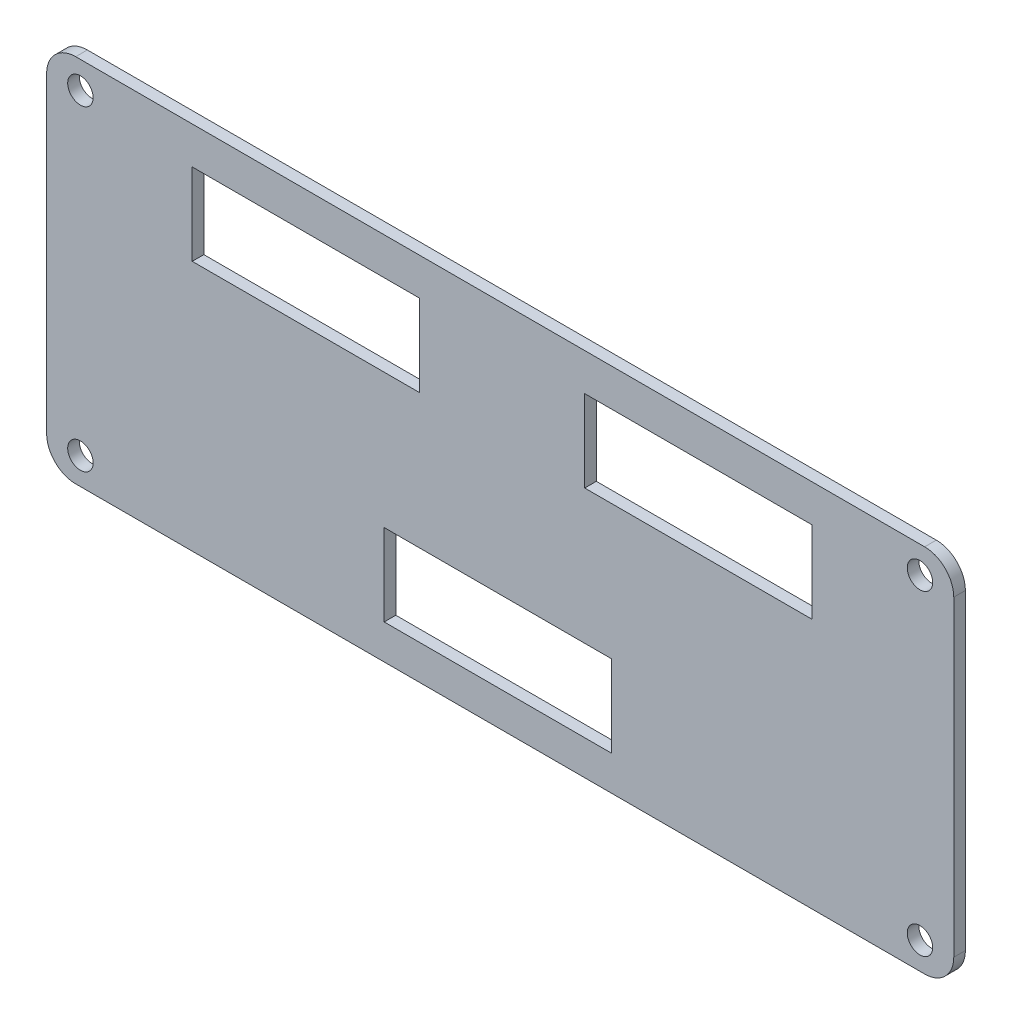
ISO-10303-21;
HEADER;
FILE_DESCRIPTION(('STEP AP214'),'2;1');
FILE_NAME('part.step','',(''),(''),'','','');
FILE_SCHEMA(('AUTOMOTIVE_DESIGN { 1 0 10303 214 1 1 1 1 }'));
ENDSEC;
DATA;
#1=APPLICATION_CONTEXT('core data for automotive mechanical design processes');
#2=APPLICATION_PROTOCOL_DEFINITION('international standard','automotive_design',2000,#1);
#3=PRODUCT_CONTEXT('',#1,'mechanical');
#4=PRODUCT('Part','Part','',(#3));
#5=PRODUCT_RELATED_PRODUCT_CATEGORY('part','',(#4));
#6=PRODUCT_DEFINITION_FORMATION('','',#4);
#7=PRODUCT_DEFINITION_CONTEXT('part definition',#1,'design');
#8=PRODUCT_DEFINITION('design','',#6,#7);
#9=PRODUCT_DEFINITION_SHAPE('','',#8);
#10=(LENGTH_UNIT() NAMED_UNIT(*) SI_UNIT(.MILLI.,.METRE.));
#11=(NAMED_UNIT(*) PLANE_ANGLE_UNIT() SI_UNIT($,.RADIAN.));
#12=(NAMED_UNIT(*) SI_UNIT($,.STERADIAN.) SOLID_ANGLE_UNIT());
#13=UNCERTAINTY_MEASURE_WITH_UNIT(LENGTH_MEASURE(1.E-05),#10,'distance_accuracy_value','');
#14=(GEOMETRIC_REPRESENTATION_CONTEXT(3) GLOBAL_UNCERTAINTY_ASSIGNED_CONTEXT((#13)) GLOBAL_UNIT_ASSIGNED_CONTEXT((#10,
#11,#12)) REPRESENTATION_CONTEXT('',''));
#15=CARTESIAN_POINT('',(0.,0.,0.));
#16=DIRECTION('',(0.,0.,1.));
#17=DIRECTION('',(1.,0.,0.));
#18=AXIS2_PLACEMENT_3D('',#15,#16,#17);
#19=CARTESIAN_POINT('',(4.65,-47.2,0.));
#20=DIRECTION('',(0.,0.,-1.));
#21=DIRECTION('',(1.,0.,0.));
#22=AXIS2_PLACEMENT_3D('',#19,#20,#21);
#23=CYLINDRICAL_SURFACE('',#22,1.75);
#24=CARTESIAN_POINT('',(4.65,-47.2,0.));
#25=DIRECTION('',(0.,0.,1.));
#26=DIRECTION('',(1.,0.,0.));
#27=AXIS2_PLACEMENT_3D('',#24,#25,#26);
#28=CIRCLE('',#27,1.75);
#29=CARTESIAN_POINT('',(6.4,-47.2,0.));
#30=VERTEX_POINT('',#29);
#31=EDGE_CURVE('E351',#30,#30,#28,.T.);
#32=ORIENTED_EDGE('',*,*,#31,.F.);
#33=DIRECTION('',(0.,0.,1.));
#34=VECTOR('',#33,1.);
#35=CARTESIAN_POINT('',(6.4,-47.2,0.));
#36=LINE('',#35,#34);
#37=CARTESIAN_POINT('',(6.4,-47.2,1.6));
#38=VERTEX_POINT('',#37);
#39=EDGE_CURVE('E10',#30,#38,#36,.T.);
#40=ORIENTED_EDGE('',*,*,#39,.T.);
#41=CARTESIAN_POINT('',(4.65,-47.2,1.6));
#42=DIRECTION('',(0.,0.,1.));
#43=DIRECTION('',(1.,0.,0.));
#44=AXIS2_PLACEMENT_3D('',#41,#42,#43);
#45=CIRCLE('',#44,1.75);
#46=EDGE_CURVE('E427',#38,#38,#45,.T.);
#47=ORIENTED_EDGE('',*,*,#46,.T.);
#48=ORIENTED_EDGE('',*,*,#39,.F.);
#49=EDGE_LOOP('',(#32,#40,#47,#48));
#50=FACE_BOUND('',#49,.T.);
#51=ADVANCED_FACE('F16',(#50),#23,.F.);
#52=CARTESIAN_POINT('',(4.65,-3.7,0.));
#53=DIRECTION('',(0.,0.,-1.));
#54=DIRECTION('',(1.,0.,0.));
#55=AXIS2_PLACEMENT_3D('',#52,#53,#54);
#56=CYLINDRICAL_SURFACE('',#55,1.75);
#57=CARTESIAN_POINT('',(4.65,-3.7,0.));
#58=DIRECTION('',(0.,0.,1.));
#59=DIRECTION('',(1.,0.,0.));
#60=AXIS2_PLACEMENT_3D('',#57,#58,#59);
#61=CIRCLE('',#60,1.75);
#62=CARTESIAN_POINT('',(6.4,-3.7,0.));
#63=VERTEX_POINT('',#62);
#64=EDGE_CURVE('E370',#63,#63,#61,.T.);
#65=ORIENTED_EDGE('',*,*,#64,.F.);
#66=DIRECTION('',(0.,0.,1.));
#67=VECTOR('',#66,1.);
#68=CARTESIAN_POINT('',(6.4,-3.7,0.));
#69=LINE('',#68,#67);
#70=CARTESIAN_POINT('',(6.4,-3.7,1.6));
#71=VERTEX_POINT('',#70);
#72=EDGE_CURVE('E27',#63,#71,#69,.T.);
#73=ORIENTED_EDGE('',*,*,#72,.T.);
#74=CARTESIAN_POINT('',(4.65,-3.7,1.6));
#75=DIRECTION('',(0.,0.,1.));
#76=DIRECTION('',(1.,0.,0.));
#77=AXIS2_PLACEMENT_3D('',#74,#75,#76);
#78=CIRCLE('',#77,1.75);
#79=EDGE_CURVE('E292',#71,#71,#78,.T.);
#80=ORIENTED_EDGE('',*,*,#79,.T.);
#81=ORIENTED_EDGE('',*,*,#72,.F.);
#82=EDGE_LOOP('',(#65,#73,#80,#81));
#83=FACE_BOUND('',#82,.T.);
#84=ADVANCED_FACE('F474',(#83),#56,.F.);
#85=CARTESIAN_POINT('',(20.03,-5.12,0.));
#86=DIRECTION('',(0.,1.,0.));
#87=DIRECTION('',(1.,0.,0.));
#88=AXIS2_PLACEMENT_3D('',#85,#86,#87);
#89=PLANE('',#88);
#90=DIRECTION('',(1.,0.,0.));
#91=VECTOR('',#90,1.);
#92=CARTESIAN_POINT('',(20.03,-5.12,0.));
#93=LINE('',#92,#91);
#94=CARTESIAN_POINT('',(20.03,-5.12,0.));
#95=VERTEX_POINT('',#94);
#96=CARTESIAN_POINT('',(51.28,-5.12,0.));
#97=VERTEX_POINT('',#96);
#98=EDGE_CURVE('E312',#95,#97,#93,.T.);
#99=ORIENTED_EDGE('',*,*,#98,.T.);
#100=DIRECTION('',(0.,0.,1.));
#101=VECTOR('',#100,1.);
#102=CARTESIAN_POINT('',(51.28,-5.12,0.));
#103=LINE('',#102,#101);
#104=CARTESIAN_POINT('',(51.28,-5.12,1.6));
#105=VERTEX_POINT('',#104);
#106=EDGE_CURVE('E336',#97,#105,#103,.T.);
#107=ORIENTED_EDGE('',*,*,#106,.T.);
#108=DIRECTION('',(1.,0.,0.));
#109=VECTOR('',#108,1.);
#110=CARTESIAN_POINT('',(20.03,-5.12,1.6));
#111=LINE('',#110,#109);
#112=CARTESIAN_POINT('',(20.03,-5.12,1.6));
#113=VERTEX_POINT('',#112);
#114=EDGE_CURVE('E269',#113,#105,#111,.T.);
#115=ORIENTED_EDGE('',*,*,#114,.F.);
#116=DIRECTION('',(0.,0.,1.));
#117=VECTOR('',#116,1.);
#118=CARTESIAN_POINT('',(20.03,-5.12,0.));
#119=LINE('',#118,#117);
#120=EDGE_CURVE('E434',#95,#113,#119,.T.);
#121=ORIENTED_EDGE('',*,*,#120,.F.);
#122=EDGE_LOOP('',(#99,#107,#115,#121));
#123=FACE_BOUND('',#122,.T.);
#124=ADVANCED_FACE('F572',(#123),#89,.F.);
#125=CARTESIAN_POINT('',(51.28,-5.12,0.));
#126=DIRECTION('',(1.,0.,0.));
#127=DIRECTION('',(0.,1.,0.));
#128=AXIS2_PLACEMENT_3D('',#125,#126,#127);
#129=PLANE('',#128);
#130=DIRECTION('',(0.,-1.,0.));
#131=VECTOR('',#130,1.);
#132=CARTESIAN_POINT('',(51.28,-5.12,0.));
#133=LINE('',#132,#131);
#134=CARTESIAN_POINT('',(51.28,-16.37,0.));
#135=VERTEX_POINT('',#134);
#136=EDGE_CURVE('E301',#97,#135,#133,.T.);
#137=ORIENTED_EDGE('',*,*,#136,.T.);
#138=DIRECTION('',(0.,0.,1.));
#139=VECTOR('',#138,1.);
#140=CARTESIAN_POINT('',(51.28,-16.37,0.));
#141=LINE('',#140,#139);
#142=CARTESIAN_POINT('',(51.28,-16.37,1.6));
#143=VERTEX_POINT('',#142);
#144=EDGE_CURVE('E333',#135,#143,#141,.T.);
#145=ORIENTED_EDGE('',*,*,#144,.T.);
#146=DIRECTION('',(0.,-1.,0.));
#147=VECTOR('',#146,1.);
#148=CARTESIAN_POINT('',(51.28,-5.12,1.6));
#149=LINE('',#148,#147);
#150=EDGE_CURVE('E272',#105,#143,#149,.T.);
#151=ORIENTED_EDGE('',*,*,#150,.F.);
#152=ORIENTED_EDGE('',*,*,#106,.F.);
#153=EDGE_LOOP('',(#137,#145,#151,#152));
#154=FACE_BOUND('',#153,.T.);
#155=ADVANCED_FACE('F569',(#154),#129,.F.);
#156=CARTESIAN_POINT('',(51.28,-16.37,0.));
#157=DIRECTION('',(0.,-1.,0.));
#158=DIRECTION('',(0.,0.,-1.));
#159=AXIS2_PLACEMENT_3D('',#156,#157,#158);
#160=PLANE('',#159);
#161=DIRECTION('',(-1.,0.,0.));
#162=VECTOR('',#161,1.);
#163=CARTESIAN_POINT('',(51.28,-16.37,0.));
#164=LINE('',#163,#162);
#165=CARTESIAN_POINT('',(20.03,-16.37,0.));
#166=VERTEX_POINT('',#165);
#167=EDGE_CURVE('E298',#135,#166,#164,.T.);
#168=ORIENTED_EDGE('',*,*,#167,.T.);
#169=DIRECTION('',(0.,0.,1.));
#170=VECTOR('',#169,1.);
#171=CARTESIAN_POINT('',(20.03,-16.37,0.));
#172=LINE('',#171,#170);
#173=CARTESIAN_POINT('',(20.03,-16.37,1.6));
#174=VERTEX_POINT('',#173);
#175=EDGE_CURVE('E337',#166,#174,#172,.T.);
#176=ORIENTED_EDGE('',*,*,#175,.T.);
#177=DIRECTION('',(-1.,0.,0.));
#178=VECTOR('',#177,1.);
#179=CARTESIAN_POINT('',(51.28,-16.37,1.6));
#180=LINE('',#179,#178);
#181=EDGE_CURVE('E284',#143,#174,#180,.T.);
#182=ORIENTED_EDGE('',*,*,#181,.F.);
#183=ORIENTED_EDGE('',*,*,#144,.F.);
#184=EDGE_LOOP('',(#168,#176,#182,#183));
#185=FACE_BOUND('',#184,.T.);
#186=ADVANCED_FACE('F563',(#185),#160,.F.);
#187=CARTESIAN_POINT('',(20.03,-16.37,0.));
#188=DIRECTION('',(-1.,0.,0.));
#189=DIRECTION('',(0.,0.,1.));
#190=AXIS2_PLACEMENT_3D('',#187,#188,#189);
#191=PLANE('',#190);
#192=DIRECTION('',(0.,1.,0.));
#193=VECTOR('',#192,1.);
#194=CARTESIAN_POINT('',(20.03,-16.37,0.));
#195=LINE('',#194,#193);
#196=EDGE_CURVE('E374',#166,#95,#195,.T.);
#197=ORIENTED_EDGE('',*,*,#196,.T.);
#198=ORIENTED_EDGE('',*,*,#120,.T.);
#199=DIRECTION('',(0.,1.,0.));
#200=VECTOR('',#199,1.);
#201=CARTESIAN_POINT('',(20.03,-16.37,1.6));
#202=LINE('',#201,#200);
#203=EDGE_CURVE('E273',#174,#113,#202,.T.);
#204=ORIENTED_EDGE('',*,*,#203,.F.);
#205=ORIENTED_EDGE('',*,*,#175,.F.);
#206=EDGE_LOOP('',(#197,#198,#204,#205));
#207=FACE_BOUND('',#206,.T.);
#208=ADVANCED_FACE('F565',(#207),#191,.F.);
#209=CARTESIAN_POINT('',(46.44,-34.88,0.));
#210=DIRECTION('',(0.,1.,0.));
#211=DIRECTION('',(1.,0.,0.));
#212=AXIS2_PLACEMENT_3D('',#209,#210,#211);
#213=PLANE('',#212);
#214=DIRECTION('',(1.,0.,0.));
#215=VECTOR('',#214,1.);
#216=CARTESIAN_POINT('',(46.44,-34.88,0.));
#217=LINE('',#216,#215);
#218=CARTESIAN_POINT('',(46.44,-34.88,0.));
#219=VERTEX_POINT('',#218);
#220=CARTESIAN_POINT('',(77.69,-34.88,0.));
#221=VERTEX_POINT('',#220);
#222=EDGE_CURVE('E317',#219,#221,#217,.T.);
#223=ORIENTED_EDGE('',*,*,#222,.T.);
#224=DIRECTION('',(0.,0.,1.));
#225=VECTOR('',#224,1.);
#226=CARTESIAN_POINT('',(77.69,-34.88,0.));
#227=LINE('',#226,#225);
#228=CARTESIAN_POINT('',(77.69,-34.88,1.6));
#229=VERTEX_POINT('',#228);
#230=EDGE_CURVE('E304',#221,#229,#227,.T.);
#231=ORIENTED_EDGE('',*,*,#230,.T.);
#232=DIRECTION('',(1.,0.,0.));
#233=VECTOR('',#232,1.);
#234=CARTESIAN_POINT('',(46.44,-34.88,1.6));
#235=LINE('',#234,#233);
#236=CARTESIAN_POINT('',(46.44,-34.88,1.6));
#237=VERTEX_POINT('',#236);
#238=EDGE_CURVE('E257',#237,#229,#235,.T.);
#239=ORIENTED_EDGE('',*,*,#238,.F.);
#240=DIRECTION('',(0.,0.,1.));
#241=VECTOR('',#240,1.);
#242=CARTESIAN_POINT('',(46.44,-34.88,0.));
#243=LINE('',#242,#241);
#244=EDGE_CURVE('E20',#219,#237,#243,.T.);
#245=ORIENTED_EDGE('',*,*,#244,.F.);
#246=EDGE_LOOP('',(#223,#231,#239,#245));
#247=FACE_BOUND('',#246,.T.);
#248=ADVANCED_FACE('F598',(#247),#213,.F.);
#249=CARTESIAN_POINT('',(46.44,-46.13,0.));
#250=DIRECTION('',(-1.,0.,0.));
#251=DIRECTION('',(0.,0.,1.));
#252=AXIS2_PLACEMENT_3D('',#249,#250,#251);
#253=PLANE('',#252);
#254=DIRECTION('',(0.,1.,0.));
#255=VECTOR('',#254,1.);
#256=CARTESIAN_POINT('',(46.44,-46.13,0.));
#257=LINE('',#256,#255);
#258=CARTESIAN_POINT('',(46.44,-46.13,0.));
#259=VERTEX_POINT('',#258);
#260=EDGE_CURVE('E321',#259,#219,#257,.T.);
#261=ORIENTED_EDGE('',*,*,#260,.T.);
#262=ORIENTED_EDGE('',*,*,#244,.T.);
#263=DIRECTION('',(0.,1.,0.));
#264=VECTOR('',#263,1.);
#265=CARTESIAN_POINT('',(46.44,-46.13,1.6));
#266=LINE('',#265,#264);
#267=CARTESIAN_POINT('',(46.44,-46.13,1.6));
#268=VERTEX_POINT('',#267);
#269=EDGE_CURVE('E238',#268,#237,#266,.T.);
#270=ORIENTED_EDGE('',*,*,#269,.F.);
#271=DIRECTION('',(0.,0.,1.));
#272=VECTOR('',#271,1.);
#273=CARTESIAN_POINT('',(46.44,-46.13,0.));
#274=LINE('',#273,#272);
#275=EDGE_CURVE('E222',#259,#268,#274,.T.);
#276=ORIENTED_EDGE('',*,*,#275,.F.);
#277=EDGE_LOOP('',(#261,#262,#270,#276));
#278=FACE_BOUND('',#277,.T.);
#279=ADVANCED_FACE('F239',(#278),#253,.F.);
#280=CARTESIAN_POINT('',(77.69,-34.88,0.));
#281=DIRECTION('',(1.,0.,0.));
#282=DIRECTION('',(0.,1.,0.));
#283=AXIS2_PLACEMENT_3D('',#280,#281,#282);
#284=PLANE('',#283);
#285=DIRECTION('',(0.,-1.,0.));
#286=VECTOR('',#285,1.);
#287=CARTESIAN_POINT('',(77.69,-34.88,0.));
#288=LINE('',#287,#286);
#289=CARTESIAN_POINT('',(77.69,-46.13,0.));
#290=VERTEX_POINT('',#289);
#291=EDGE_CURVE('E322',#221,#290,#288,.T.);
#292=ORIENTED_EDGE('',*,*,#291,.T.);
#293=DIRECTION('',(0.,0.,1.));
#294=VECTOR('',#293,1.);
#295=CARTESIAN_POINT('',(77.69,-46.13,0.));
#296=LINE('',#295,#294);
#297=CARTESIAN_POINT('',(77.69,-46.13,1.6));
#298=VERTEX_POINT('',#297);
#299=EDGE_CURVE('E234',#290,#298,#296,.T.);
#300=ORIENTED_EDGE('',*,*,#299,.T.);
#301=DIRECTION('',(0.,-1.,0.));
#302=VECTOR('',#301,1.);
#303=CARTESIAN_POINT('',(77.69,-34.88,1.6));
#304=LINE('',#303,#302);
#305=EDGE_CURVE('E250',#229,#298,#304,.T.);
#306=ORIENTED_EDGE('',*,*,#305,.F.);
#307=ORIENTED_EDGE('',*,*,#230,.F.);
#308=EDGE_LOOP('',(#292,#300,#306,#307));
#309=FACE_BOUND('',#308,.T.);
#310=ADVANCED_FACE('F597',(#309),#284,.F.);
#311=CARTESIAN_POINT('',(77.69,-46.13,0.));
#312=DIRECTION('',(0.,-1.,0.));
#313=DIRECTION('',(0.,0.,-1.));
#314=AXIS2_PLACEMENT_3D('',#311,#312,#313);
#315=PLANE('',#314);
#316=DIRECTION('',(-1.,0.,0.));
#317=VECTOR('',#316,1.);
#318=CARTESIAN_POINT('',(77.69,-46.13,0.));
#319=LINE('',#318,#317);
#320=EDGE_CURVE('E229',#290,#259,#319,.T.);
#321=ORIENTED_EDGE('',*,*,#320,.T.);
#322=ORIENTED_EDGE('',*,*,#275,.T.);
#323=DIRECTION('',(-1.,0.,0.));
#324=VECTOR('',#323,1.);
#325=CARTESIAN_POINT('',(77.69,-46.13,1.6));
#326=LINE('',#325,#324);
#327=EDGE_CURVE('E226',#298,#268,#326,.T.);
#328=ORIENTED_EDGE('',*,*,#327,.F.);
#329=ORIENTED_EDGE('',*,*,#299,.F.);
#330=EDGE_LOOP('',(#321,#322,#328,#329));
#331=FACE_BOUND('',#330,.T.);
#332=ADVANCED_FACE('F224',(#331),#315,.F.);
#333=CARTESIAN_POINT('',(74.03,-5.13,0.));
#334=DIRECTION('',(0.,1.,0.));
#335=DIRECTION('',(1.,0.,0.));
#336=AXIS2_PLACEMENT_3D('',#333,#334,#335);
#337=PLANE('',#336);
#338=DIRECTION('',(1.,0.,0.));
#339=VECTOR('',#338,1.);
#340=CARTESIAN_POINT('',(74.03,-5.13,0.));
#341=LINE('',#340,#339);
#342=CARTESIAN_POINT('',(74.03,-5.13,0.));
#343=VERTEX_POINT('',#342);
#344=CARTESIAN_POINT('',(105.28,-5.13,0.));
#345=VERTEX_POINT('',#344);
#346=EDGE_CURVE('E401',#343,#345,#341,.T.);
#347=ORIENTED_EDGE('',*,*,#346,.T.);
#348=DIRECTION('',(0.,0.,1.));
#349=VECTOR('',#348,1.);
#350=CARTESIAN_POINT('',(105.28,-5.13,0.));
#351=LINE('',#350,#349);
#352=CARTESIAN_POINT('',(105.28,-5.13,1.6));
#353=VERTEX_POINT('',#352);
#354=EDGE_CURVE('E418',#345,#353,#351,.T.);
#355=ORIENTED_EDGE('',*,*,#354,.T.);
#356=DIRECTION('',(1.,0.,0.));
#357=VECTOR('',#356,1.);
#358=CARTESIAN_POINT('',(74.03,-5.13,1.6));
#359=LINE('',#358,#357);
#360=CARTESIAN_POINT('',(74.03,-5.13,1.6));
#361=VERTEX_POINT('',#360);
#362=EDGE_CURVE('E378',#361,#353,#359,.T.);
#363=ORIENTED_EDGE('',*,*,#362,.F.);
#364=DIRECTION('',(0.,0.,1.));
#365=VECTOR('',#364,1.);
#366=CARTESIAN_POINT('',(74.03,-5.13,0.));
#367=LINE('',#366,#365);
#368=EDGE_CURVE('E235',#343,#361,#367,.T.);
#369=ORIENTED_EDGE('',*,*,#368,.F.);
#370=EDGE_LOOP('',(#347,#355,#363,#369));
#371=FACE_BOUND('',#370,.T.);
#372=ADVANCED_FACE('F546',(#371),#337,.F.);
#373=CARTESIAN_POINT('',(74.03,-16.38,0.));
#374=DIRECTION('',(-1.,0.,0.));
#375=DIRECTION('',(0.,0.,1.));
#376=AXIS2_PLACEMENT_3D('',#373,#374,#375);
#377=PLANE('',#376);
#378=DIRECTION('',(0.,1.,0.));
#379=VECTOR('',#378,1.);
#380=CARTESIAN_POINT('',(74.03,-16.38,0.));
#381=LINE('',#380,#379);
#382=CARTESIAN_POINT('',(74.03,-16.38,0.));
#383=VERTEX_POINT('',#382);
#384=EDGE_CURVE('E405',#383,#343,#381,.T.);
#385=ORIENTED_EDGE('',*,*,#384,.T.);
#386=ORIENTED_EDGE('',*,*,#368,.T.);
#387=DIRECTION('',(0.,1.,0.));
#388=VECTOR('',#387,1.);
#389=CARTESIAN_POINT('',(74.03,-16.38,1.6));
#390=LINE('',#389,#388);
#391=CARTESIAN_POINT('',(74.03,-16.38,1.6));
#392=VERTEX_POINT('',#391);
#393=EDGE_CURVE('E379',#392,#361,#390,.T.);
#394=ORIENTED_EDGE('',*,*,#393,.F.);
#395=DIRECTION('',(0.,0.,1.));
#396=VECTOR('',#395,1.);
#397=CARTESIAN_POINT('',(74.03,-16.38,0.));
#398=LINE('',#397,#396);
#399=EDGE_CURVE('E419',#383,#392,#398,.T.);
#400=ORIENTED_EDGE('',*,*,#399,.F.);
#401=EDGE_LOOP('',(#385,#386,#394,#400));
#402=FACE_BOUND('',#401,.T.);
#403=ADVANCED_FACE('F543',(#402),#377,.F.);
#404=CARTESIAN_POINT('',(105.28,-5.13,0.));
#405=DIRECTION('',(1.,0.,0.));
#406=DIRECTION('',(0.,1.,0.));
#407=AXIS2_PLACEMENT_3D('',#404,#405,#406);
#408=PLANE('',#407);
#409=DIRECTION('',(0.,-1.,0.));
#410=VECTOR('',#409,1.);
#411=CARTESIAN_POINT('',(105.28,-5.13,0.));
#412=LINE('',#411,#410);
#413=CARTESIAN_POINT('',(105.28,-16.38,0.));
#414=VERTEX_POINT('',#413);
#415=EDGE_CURVE('E406',#345,#414,#412,.T.);
#416=ORIENTED_EDGE('',*,*,#415,.T.);
#417=DIRECTION('',(0.,0.,1.));
#418=VECTOR('',#417,1.);
#419=CARTESIAN_POINT('',(105.28,-16.38,0.));
#420=LINE('',#419,#418);
#421=CARTESIAN_POINT('',(105.28,-16.38,1.6));
#422=VERTEX_POINT('',#421);
#423=EDGE_CURVE('E416',#414,#422,#420,.T.);
#424=ORIENTED_EDGE('',*,*,#423,.T.);
#425=DIRECTION('',(0.,-1.,0.));
#426=VECTOR('',#425,1.);
#427=CARTESIAN_POINT('',(105.28,-5.13,1.6));
#428=LINE('',#427,#426);
#429=EDGE_CURVE('E533',#353,#422,#428,.T.);
#430=ORIENTED_EDGE('',*,*,#429,.F.);
#431=ORIENTED_EDGE('',*,*,#354,.F.);
#432=EDGE_LOOP('',(#416,#424,#430,#431));
#433=FACE_BOUND('',#432,.T.);
#434=ADVANCED_FACE('F591',(#433),#408,.F.);
#435=CARTESIAN_POINT('',(105.28,-16.38,0.));
#436=DIRECTION('',(0.,-1.,0.));
#437=DIRECTION('',(0.,0.,-1.));
#438=AXIS2_PLACEMENT_3D('',#435,#436,#437);
#439=PLANE('',#438);
#440=DIRECTION('',(-1.,0.,0.));
#441=VECTOR('',#440,1.);
#442=CARTESIAN_POINT('',(105.28,-16.38,0.));
#443=LINE('',#442,#441);
#444=EDGE_CURVE('E449',#414,#383,#443,.T.);
#445=ORIENTED_EDGE('',*,*,#444,.T.);
#446=ORIENTED_EDGE('',*,*,#399,.T.);
#447=DIRECTION('',(-1.,0.,0.));
#448=VECTOR('',#447,1.);
#449=CARTESIAN_POINT('',(105.28,-16.38,1.6));
#450=LINE('',#449,#448);
#451=EDGE_CURVE('E296',#422,#392,#450,.T.);
#452=ORIENTED_EDGE('',*,*,#451,.F.);
#453=ORIENTED_EDGE('',*,*,#423,.F.);
#454=EDGE_LOOP('',(#445,#446,#452,#453));
#455=FACE_BOUND('',#454,.T.);
#456=ADVANCED_FACE('F594',(#455),#439,.F.);
#457=CARTESIAN_POINT('',(120.15,-3.7,0.));
#458=DIRECTION('',(0.,0.,-1.));
#459=DIRECTION('',(1.,0.,0.));
#460=AXIS2_PLACEMENT_3D('',#457,#458,#459);
#461=CYLINDRICAL_SURFACE('',#460,1.75);
#462=CARTESIAN_POINT('',(120.15,-3.7,0.));
#463=DIRECTION('',(0.,0.,1.));
#464=DIRECTION('',(1.,0.,0.));
#465=AXIS2_PLACEMENT_3D('',#462,#463,#464);
#466=CIRCLE('',#465,1.75);
#467=CARTESIAN_POINT('',(121.9,-3.7,0.));
#468=VERTEX_POINT('',#467);
#469=EDGE_CURVE('E261',#468,#468,#466,.T.);
#470=ORIENTED_EDGE('',*,*,#469,.F.);
#471=DIRECTION('',(0.,0.,1.));
#472=VECTOR('',#471,1.);
#473=CARTESIAN_POINT('',(121.9,-3.7,0.));
#474=LINE('',#473,#472);
#475=CARTESIAN_POINT('',(121.9,-3.7,1.6));
#476=VERTEX_POINT('',#475);
#477=EDGE_CURVE('E326',#468,#476,#474,.T.);
#478=ORIENTED_EDGE('',*,*,#477,.T.);
#479=CARTESIAN_POINT('',(120.15,-3.7,1.6));
#480=DIRECTION('',(0.,0.,1.));
#481=DIRECTION('',(1.,0.,0.));
#482=AXIS2_PLACEMENT_3D('',#479,#480,#481);
#483=CIRCLE('',#482,1.75);
#484=EDGE_CURVE('E281',#476,#476,#483,.T.);
#485=ORIENTED_EDGE('',*,*,#484,.T.);
#486=ORIENTED_EDGE('',*,*,#477,.F.);
#487=EDGE_LOOP('',(#470,#478,#485,#486));
#488=FACE_BOUND('',#487,.T.);
#489=ADVANCED_FACE('F620',(#488),#461,.F.);
#490=CARTESIAN_POINT('',(120.15,-47.2,0.));
#491=DIRECTION('',(0.,0.,-1.));
#492=DIRECTION('',(1.,0.,0.));
#493=AXIS2_PLACEMENT_3D('',#490,#491,#492);
#494=CYLINDRICAL_SURFACE('',#493,1.75);
#495=CARTESIAN_POINT('',(120.15,-47.2,0.));
#496=DIRECTION('',(0.,0.,1.));
#497=DIRECTION('',(1.,0.,0.));
#498=AXIS2_PLACEMENT_3D('',#495,#496,#497);
#499=CIRCLE('',#498,1.75);
#500=CARTESIAN_POINT('',(121.9,-47.2,0.));
#501=VERTEX_POINT('',#500);
#502=EDGE_CURVE('E352',#501,#501,#499,.T.);
#503=ORIENTED_EDGE('',*,*,#502,.F.);
#504=DIRECTION('',(0.,0.,1.));
#505=VECTOR('',#504,1.);
#506=CARTESIAN_POINT('',(121.9,-47.2,0.));
#507=LINE('',#506,#505);
#508=CARTESIAN_POINT('',(121.9,-47.2,1.6));
#509=VERTEX_POINT('',#508);
#510=EDGE_CURVE('E323',#501,#509,#507,.T.);
#511=ORIENTED_EDGE('',*,*,#510,.T.);
#512=CARTESIAN_POINT('',(120.15,-47.2,1.6));
#513=DIRECTION('',(0.,0.,1.));
#514=DIRECTION('',(1.,0.,0.));
#515=AXIS2_PLACEMENT_3D('',#512,#513,#514);
#516=CIRCLE('',#515,1.75);
#517=EDGE_CURVE('E245',#509,#509,#516,.T.);
#518=ORIENTED_EDGE('',*,*,#517,.T.);
#519=ORIENTED_EDGE('',*,*,#510,.F.);
#520=EDGE_LOOP('',(#503,#511,#518,#519));
#521=FACE_BOUND('',#520,.T.);
#522=ADVANCED_FACE('F629',(#521),#494,.F.);
#523=CARTESIAN_POINT('',(4.,-4.,0.));
#524=DIRECTION('',(0.,0.,-1.));
#525=DIRECTION('',(1.,0.,0.));
#526=AXIS2_PLACEMENT_3D('',#523,#524,#525);
#527=CYLINDRICAL_SURFACE('',#526,4.);
#528=CARTESIAN_POINT('',(4.,-4.,0.));
#529=DIRECTION('',(0.,0.,1.));
#530=DIRECTION('',(1.,0.,0.));
#531=AXIS2_PLACEMENT_3D('',#528,#529,#530);
#532=CIRCLE('',#531,4.);
#533=CARTESIAN_POINT('',(4.,0.,0.));
#534=VERTEX_POINT('',#533);
#535=CARTESIAN_POINT('',(0.,-4.,0.));
#536=VERTEX_POINT('',#535);
#537=EDGE_CURVE('E338',#534,#536,#532,.T.);
#538=ORIENTED_EDGE('',*,*,#537,.T.);
#539=DIRECTION('',(0.,0.,1.));
#540=VECTOR('',#539,1.);
#541=CARTESIAN_POINT('',(0.,-4.,0.));
#542=LINE('',#541,#540);
#543=CARTESIAN_POINT('',(0.,-4.,1.6));
#544=VERTEX_POINT('',#543);
#545=EDGE_CURVE('E359',#536,#544,#542,.T.);
#546=ORIENTED_EDGE('',*,*,#545,.T.);
#547=CARTESIAN_POINT('',(4.,-4.,1.6));
#548=DIRECTION('',(0.,0.,1.));
#549=DIRECTION('',(1.,0.,0.));
#550=AXIS2_PLACEMENT_3D('',#547,#548,#549);
#551=CIRCLE('',#550,4.);
#552=CARTESIAN_POINT('',(4.,0.,1.6));
#553=VERTEX_POINT('',#552);
#554=EDGE_CURVE('E328',#553,#544,#551,.T.);
#555=ORIENTED_EDGE('',*,*,#554,.F.);
#556=DIRECTION('',(0.,0.,1.));
#557=VECTOR('',#556,1.);
#558=CARTESIAN_POINT('',(4.,0.,0.));
#559=LINE('',#558,#557);
#560=EDGE_CURVE('E327',#534,#553,#559,.T.);
#561=ORIENTED_EDGE('',*,*,#560,.F.);
#562=EDGE_LOOP('',(#538,#546,#555,#561));
#563=FACE_BOUND('',#562,.T.);
#564=ADVANCED_FACE('F519',(#563),#527,.T.);
#565=CARTESIAN_POINT('',(120.8,0.,0.));
#566=DIRECTION('',(0.,-1.,0.));
#567=DIRECTION('',(0.,0.,-1.));
#568=AXIS2_PLACEMENT_3D('',#565,#566,#567);
#569=PLANE('',#568);
#570=DIRECTION('',(-1.,0.,0.));
#571=VECTOR('',#570,1.);
#572=CARTESIAN_POINT('',(120.8,0.,0.));
#573=LINE('',#572,#571);
#574=CARTESIAN_POINT('',(120.8,0.,0.));
#575=VERTEX_POINT('',#574);
#576=EDGE_CURVE('E342',#575,#534,#573,.T.);
#577=ORIENTED_EDGE('',*,*,#576,.T.);
#578=ORIENTED_EDGE('',*,*,#560,.T.);
#579=DIRECTION('',(-1.,0.,0.));
#580=VECTOR('',#579,1.);
#581=CARTESIAN_POINT('',(120.8,0.,1.6));
#582=LINE('',#581,#580);
#583=CARTESIAN_POINT('',(120.8,0.,1.6));
#584=VERTEX_POINT('',#583);
#585=EDGE_CURVE('E332',#584,#553,#582,.T.);
#586=ORIENTED_EDGE('',*,*,#585,.F.);
#587=DIRECTION('',(0.,0.,1.));
#588=VECTOR('',#587,1.);
#589=CARTESIAN_POINT('',(120.8,0.,0.));
#590=LINE('',#589,#588);
#591=EDGE_CURVE('E366',#575,#584,#590,.T.);
#592=ORIENTED_EDGE('',*,*,#591,.F.);
#593=EDGE_LOOP('',(#577,#578,#586,#592));
#594=FACE_BOUND('',#593,.T.);
#595=ADVANCED_FACE('F524',(#594),#569,.F.);
#596=CARTESIAN_POINT('',(0.,-4.,0.));
#597=DIRECTION('',(1.,0.,0.));
#598=DIRECTION('',(0.,1.,0.));
#599=AXIS2_PLACEMENT_3D('',#596,#597,#598);
#600=PLANE('',#599);
#601=DIRECTION('',(0.,-1.,0.));
#602=VECTOR('',#601,1.);
#603=CARTESIAN_POINT('',(0.,-4.,0.));
#604=LINE('',#603,#602);
#605=CARTESIAN_POINT('',(0.,-47.,0.));
#606=VERTEX_POINT('',#605);
#607=EDGE_CURVE('E343',#536,#606,#604,.T.);
#608=ORIENTED_EDGE('',*,*,#607,.T.);
#609=DIRECTION('',(0.,0.,1.));
#610=VECTOR('',#609,1.);
#611=CARTESIAN_POINT('',(0.,-47.,0.));
#612=LINE('',#611,#610);
#613=CARTESIAN_POINT('',(0.,-47.,1.6));
#614=VERTEX_POINT('',#613);
#615=EDGE_CURVE('E428',#606,#614,#612,.T.);
#616=ORIENTED_EDGE('',*,*,#615,.T.);
#617=DIRECTION('',(0.,-1.,0.));
#618=VECTOR('',#617,1.);
#619=CARTESIAN_POINT('',(0.,-4.,1.6));
#620=LINE('',#619,#618);
#621=EDGE_CURVE('E308',#544,#614,#620,.T.);
#622=ORIENTED_EDGE('',*,*,#621,.F.);
#623=ORIENTED_EDGE('',*,*,#545,.F.);
#624=EDGE_LOOP('',(#608,#616,#622,#623));
#625=FACE_BOUND('',#624,.T.);
#626=ADVANCED_FACE('F514',(#625),#600,.F.);
#627=CARTESIAN_POINT('',(120.8,-4.,0.));
#628=DIRECTION('',(0.,0.,-1.));
#629=DIRECTION('',(1.,0.,0.));
#630=AXIS2_PLACEMENT_3D('',#627,#628,#629);
#631=CYLINDRICAL_SURFACE('',#630,4.);
#632=CARTESIAN_POINT('',(120.8,-4.,0.));
#633=DIRECTION('',(0.,0.,1.));
#634=DIRECTION('',(1.,0.,0.));
#635=AXIS2_PLACEMENT_3D('',#632,#633,#634);
#636=CIRCLE('',#635,4.);
#637=CARTESIAN_POINT('',(124.8,-4.,0.));
#638=VERTEX_POINT('',#637);
#639=EDGE_CURVE('E356',#638,#575,#636,.T.);
#640=ORIENTED_EDGE('',*,*,#639,.T.);
#641=ORIENTED_EDGE('',*,*,#591,.T.);
#642=CARTESIAN_POINT('',(120.8,-4.,1.6));
#643=DIRECTION('',(0.,0.,1.));
#644=DIRECTION('',(1.,0.,0.));
#645=AXIS2_PLACEMENT_3D('',#642,#643,#644);
#646=CIRCLE('',#645,4.);
#647=CARTESIAN_POINT('',(124.8,-4.,1.6));
#648=VERTEX_POINT('',#647);
#649=EDGE_CURVE('E347',#648,#584,#646,.T.);
#650=ORIENTED_EDGE('',*,*,#649,.F.);
#651=DIRECTION('',(0.,0.,1.));
#652=VECTOR('',#651,1.);
#653=CARTESIAN_POINT('',(124.8,-4.,0.));
#654=LINE('',#653,#652);
#655=EDGE_CURVE('E264',#638,#648,#654,.T.);
#656=ORIENTED_EDGE('',*,*,#655,.F.);
#657=EDGE_LOOP('',(#640,#641,#650,#656));
#658=FACE_BOUND('',#657,.T.);
#659=ADVANCED_FACE('F659',(#658),#631,.T.);
#660=CARTESIAN_POINT('',(4.,-46.9,0.));
#661=DIRECTION('',(0.,0.,-1.));
#662=DIRECTION('',(1.,0.,0.));
#663=AXIS2_PLACEMENT_3D('',#660,#661,#662);
#664=CYLINDRICAL_SURFACE('',#663,4.001249804749);
#665=CARTESIAN_POINT('',(4.,-46.9,0.));
#666=DIRECTION('',(0.,0.,1.));
#667=DIRECTION('',(1.,0.,0.));
#668=AXIS2_PLACEMENT_3D('',#665,#666,#667);
#669=CIRCLE('',#668,4.001249804749);
#670=CARTESIAN_POINT('',(4.1,-50.9,0.));
#671=VERTEX_POINT('',#670);
#672=EDGE_CURVE('E363',#606,#671,#669,.T.);
#673=ORIENTED_EDGE('',*,*,#672,.T.);
#674=DIRECTION('',(0.,0.,1.));
#675=VECTOR('',#674,1.);
#676=CARTESIAN_POINT('',(4.1,-50.9,0.));
#677=LINE('',#676,#675);
#678=CARTESIAN_POINT('',(4.1,-50.9,1.6));
#679=VERTEX_POINT('',#678);
#680=EDGE_CURVE('E265',#671,#679,#677,.T.);
#681=ORIENTED_EDGE('',*,*,#680,.T.);
#682=CARTESIAN_POINT('',(4.,-46.9,1.6));
#683=DIRECTION('',(0.,0.,1.));
#684=DIRECTION('',(1.,0.,0.));
#685=AXIS2_PLACEMENT_3D('',#682,#683,#684);
#686=CIRCLE('',#685,4.001249804749);
#687=EDGE_CURVE('E305',#614,#679,#686,.T.);
#688=ORIENTED_EDGE('',*,*,#687,.F.);
#689=ORIENTED_EDGE('',*,*,#615,.F.);
#690=EDGE_LOOP('',(#673,#681,#688,#689));
#691=FACE_BOUND('',#690,.T.);
#692=ADVANCED_FACE('F512',(#691),#664,.T.);
#693=CARTESIAN_POINT('',(62.399602953014,-25.45011024283,1.6));
#694=DIRECTION('',(0.,0.,1.));
#695=DIRECTION('',(1.,0.,0.));
#696=AXIS2_PLACEMENT_3D('',#693,#694,#695);
#697=PLANE('',#696);
#698=ORIENTED_EDGE('',*,*,#46,.F.);
#699=EDGE_LOOP('',(#698));
#700=FACE_BOUND('',#699,.T.);
#701=ORIENTED_EDGE('',*,*,#517,.F.);
#702=EDGE_LOOP('',(#701));
#703=FACE_BOUND('',#702,.T.);
#704=ORIENTED_EDGE('',*,*,#238,.T.);
#705=ORIENTED_EDGE('',*,*,#305,.T.);
#706=ORIENTED_EDGE('',*,*,#327,.T.);
#707=ORIENTED_EDGE('',*,*,#269,.T.);
#708=EDGE_LOOP('',(#704,#705,#706,#707));
#709=FACE_BOUND('',#708,.T.);
#710=ORIENTED_EDGE('',*,*,#362,.T.);
#711=ORIENTED_EDGE('',*,*,#429,.T.);
#712=ORIENTED_EDGE('',*,*,#451,.T.);
#713=ORIENTED_EDGE('',*,*,#393,.T.);
#714=EDGE_LOOP('',(#710,#711,#712,#713));
#715=FACE_BOUND('',#714,.T.);
#716=ORIENTED_EDGE('',*,*,#484,.F.);
#717=EDGE_LOOP('',(#716));
#718=FACE_BOUND('',#717,.T.);
#719=ORIENTED_EDGE('',*,*,#181,.T.);
#720=ORIENTED_EDGE('',*,*,#203,.T.);
#721=ORIENTED_EDGE('',*,*,#114,.T.);
#722=ORIENTED_EDGE('',*,*,#150,.T.);
#723=EDGE_LOOP('',(#719,#720,#721,#722));
#724=FACE_BOUND('',#723,.T.);
#725=ORIENTED_EDGE('',*,*,#79,.F.);
#726=EDGE_LOOP('',(#725));
#727=FACE_BOUND('',#726,.T.);
#728=CARTESIAN_POINT('',(120.8,-46.9,1.6));
#729=DIRECTION('',(0.,0.,1.));
#730=DIRECTION('',(1.,0.,0.));
#731=AXIS2_PLACEMENT_3D('',#728,#729,#730);
#732=CIRCLE('',#731,4.);
#733=CARTESIAN_POINT('',(120.8,-50.9,1.6));
#734=VERTEX_POINT('',#733);
#735=CARTESIAN_POINT('',(124.8,-46.9,1.6));
#736=VERTEX_POINT('',#735);
#737=EDGE_CURVE('E369',#734,#736,#732,.T.);
#738=ORIENTED_EDGE('',*,*,#737,.T.);
#739=DIRECTION('',(0.,1.,0.));
#740=VECTOR('',#739,1.);
#741=CARTESIAN_POINT('',(124.8,-46.9,1.6));
#742=LINE('',#741,#740);
#743=EDGE_CURVE('E268',#736,#648,#742,.T.);
#744=ORIENTED_EDGE('',*,*,#743,.T.);
#745=ORIENTED_EDGE('',*,*,#649,.T.);
#746=ORIENTED_EDGE('',*,*,#585,.T.);
#747=ORIENTED_EDGE('',*,*,#554,.T.);
#748=ORIENTED_EDGE('',*,*,#621,.T.);
#749=ORIENTED_EDGE('',*,*,#687,.T.);
#750=DIRECTION('',(1.,0.,0.));
#751=VECTOR('',#750,1.);
#752=CARTESIAN_POINT('',(4.1,-50.9,1.6));
#753=LINE('',#752,#751);
#754=EDGE_CURVE('E313',#679,#734,#753,.T.);
#755=ORIENTED_EDGE('',*,*,#754,.T.);
#756=EDGE_LOOP('',(#738,#744,#745,#746,#747,#748,#749,#755));
#757=FACE_BOUND('',#756,.T.);
#758=ADVANCED_FACE('F247',(#700,#703,#709,#715,#718,#724,#727,#757),#697,.T.);
#759=CARTESIAN_POINT('',(62.399602953014,-25.45011024283,0.));
#760=DIRECTION('',(0.,0.,1.));
#761=DIRECTION('',(1.,0.,0.));
#762=AXIS2_PLACEMENT_3D('',#759,#760,#761);
#763=PLANE('',#762);
#764=ORIENTED_EDGE('',*,*,#31,.T.);
#765=EDGE_LOOP('',(#764));
#766=FACE_BOUND('',#765,.T.);
#767=ORIENTED_EDGE('',*,*,#64,.T.);
#768=EDGE_LOOP('',(#767));
#769=FACE_BOUND('',#768,.T.);
#770=ORIENTED_EDGE('',*,*,#167,.F.);
#771=ORIENTED_EDGE('',*,*,#136,.F.);
#772=ORIENTED_EDGE('',*,*,#98,.F.);
#773=ORIENTED_EDGE('',*,*,#196,.F.);
#774=EDGE_LOOP('',(#770,#771,#772,#773));
#775=FACE_BOUND('',#774,.T.);
#776=ORIENTED_EDGE('',*,*,#291,.F.);
#777=ORIENTED_EDGE('',*,*,#222,.F.);
#778=ORIENTED_EDGE('',*,*,#260,.F.);
#779=ORIENTED_EDGE('',*,*,#320,.F.);
#780=EDGE_LOOP('',(#776,#777,#778,#779));
#781=FACE_BOUND('',#780,.T.);
#782=ORIENTED_EDGE('',*,*,#415,.F.);
#783=ORIENTED_EDGE('',*,*,#346,.F.);
#784=ORIENTED_EDGE('',*,*,#384,.F.);
#785=ORIENTED_EDGE('',*,*,#444,.F.);
#786=EDGE_LOOP('',(#782,#783,#784,#785));
#787=FACE_BOUND('',#786,.T.);
#788=ORIENTED_EDGE('',*,*,#469,.T.);
#789=EDGE_LOOP('',(#788));
#790=FACE_BOUND('',#789,.T.);
#791=ORIENTED_EDGE('',*,*,#502,.T.);
#792=EDGE_LOOP('',(#791));
#793=FACE_BOUND('',#792,.T.);
#794=DIRECTION('',(1.,0.,0.));
#795=VECTOR('',#794,1.);
#796=CARTESIAN_POINT('',(4.1,-50.9,0.));
#797=LINE('',#796,#795);
#798=CARTESIAN_POINT('',(120.8,-50.9,0.));
#799=VERTEX_POINT('',#798);
#800=EDGE_CURVE('E180',#671,#799,#797,.T.);
#801=ORIENTED_EDGE('',*,*,#800,.F.);
#802=ORIENTED_EDGE('',*,*,#672,.F.);
#803=ORIENTED_EDGE('',*,*,#607,.F.);
#804=ORIENTED_EDGE('',*,*,#537,.F.);
#805=ORIENTED_EDGE('',*,*,#576,.F.);
#806=ORIENTED_EDGE('',*,*,#639,.F.);
#807=DIRECTION('',(0.,1.,0.));
#808=VECTOR('',#807,1.);
#809=CARTESIAN_POINT('',(124.8,-46.9,0.));
#810=LINE('',#809,#808);
#811=CARTESIAN_POINT('',(124.8,-46.9,0.));
#812=VERTEX_POINT('',#811);
#813=EDGE_CURVE('E191',#812,#638,#810,.T.);
#814=ORIENTED_EDGE('',*,*,#813,.F.);
#815=CARTESIAN_POINT('',(120.8,-46.9,0.));
#816=DIRECTION('',(0.,0.,1.));
#817=DIRECTION('',(1.,0.,0.));
#818=AXIS2_PLACEMENT_3D('',#815,#816,#817);
#819=CIRCLE('',#818,4.);
#820=EDGE_CURVE('E392',#799,#812,#819,.T.);
#821=ORIENTED_EDGE('',*,*,#820,.F.);
#822=EDGE_LOOP('',(#801,#802,#803,#804,#805,#806,#814,#821));
#823=FACE_BOUND('',#822,.T.);
#824=ADVANCED_FACE('F477',(#766,#769,#775,#781,#787,#790,#793,#823),#763,.F.);
#825=CARTESIAN_POINT('',(124.8,-46.9,0.));
#826=DIRECTION('',(-1.,0.,0.));
#827=DIRECTION('',(0.,0.,1.));
#828=AXIS2_PLACEMENT_3D('',#825,#826,#827);
#829=PLANE('',#828);
#830=ORIENTED_EDGE('',*,*,#813,.T.);
#831=ORIENTED_EDGE('',*,*,#655,.T.);
#832=ORIENTED_EDGE('',*,*,#743,.F.);
#833=DIRECTION('',(0.,0.,1.));
#834=VECTOR('',#833,1.);
#835=CARTESIAN_POINT('',(124.8,-46.9,0.));
#836=LINE('',#835,#834);
#837=EDGE_CURVE('E388',#812,#736,#836,.T.);
#838=ORIENTED_EDGE('',*,*,#837,.F.);
#839=EDGE_LOOP('',(#830,#831,#832,#838));
#840=FACE_BOUND('',#839,.T.);
#841=ADVANCED_FACE('F480',(#840),#829,.F.);
#842=CARTESIAN_POINT('',(4.1,-50.9,0.));
#843=DIRECTION('',(0.,1.,0.));
#844=DIRECTION('',(1.,0.,0.));
#845=AXIS2_PLACEMENT_3D('',#842,#843,#844);
#846=PLANE('',#845);
#847=ORIENTED_EDGE('',*,*,#800,.T.);
#848=DIRECTION('',(0.,0.,1.));
#849=VECTOR('',#848,1.);
#850=CARTESIAN_POINT('',(120.8,-50.9,0.));
#851=LINE('',#850,#849);
#852=EDGE_CURVE('E346',#799,#734,#851,.T.);
#853=ORIENTED_EDGE('',*,*,#852,.T.);
#854=ORIENTED_EDGE('',*,*,#754,.F.);
#855=ORIENTED_EDGE('',*,*,#680,.F.);
#856=EDGE_LOOP('',(#847,#853,#854,#855));
#857=FACE_BOUND('',#856,.T.);
#858=ADVANCED_FACE('F18',(#857),#846,.F.);
#859=CARTESIAN_POINT('',(120.8,-46.9,0.));
#860=DIRECTION('',(0.,0.,-1.));
#861=DIRECTION('',(1.,0.,0.));
#862=AXIS2_PLACEMENT_3D('',#859,#860,#861);
#863=CYLINDRICAL_SURFACE('',#862,4.);
#864=ORIENTED_EDGE('',*,*,#820,.T.);
#865=ORIENTED_EDGE('',*,*,#837,.T.);
#866=ORIENTED_EDGE('',*,*,#737,.F.);
#867=ORIENTED_EDGE('',*,*,#852,.F.);
#868=EDGE_LOOP('',(#864,#865,#866,#867));
#869=FACE_BOUND('',#868,.T.);
#870=ADVANCED_FACE('F502',(#869),#863,.T.);
#871=CLOSED_SHELL('',(#51,#84,#124,#155,#186,#208,#248,#279,#310,#332,#372,#403,#434,#456,#489,
#522,#564,#595,#626,#659,#692,#758,#824,#841,#858,#870));
#872=MANIFOLD_SOLID_BREP('B1',#871);
#873=ADVANCED_BREP_SHAPE_REPRESENTATION('',(#18,#872),#14);
#874=SHAPE_DEFINITION_REPRESENTATION(#9,#873);
ENDSEC;
END-ISO-10303-21;
